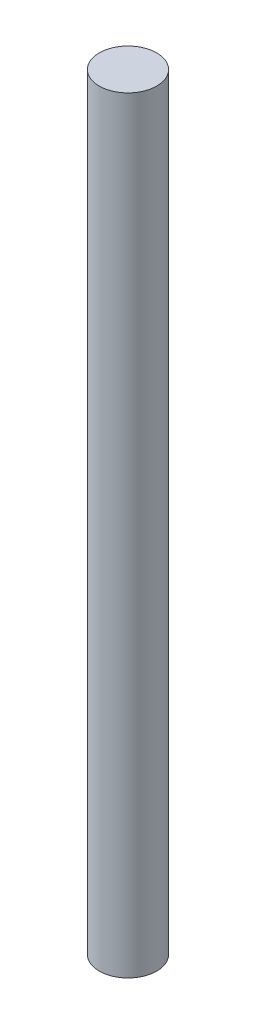
ISO-10303-21;
HEADER;
FILE_DESCRIPTION(('STEP AP214'),'2;1');
FILE_NAME('part.step','',(''),(''),'','','');
FILE_SCHEMA(('AUTOMOTIVE_DESIGN { 1 0 10303 214 1 1 1 1 }'));
ENDSEC;
DATA;
#1=APPLICATION_CONTEXT('core data for automotive mechanical design processes');
#2=APPLICATION_PROTOCOL_DEFINITION('international standard','automotive_design',2000,#1);
#3=PRODUCT_CONTEXT('',#1,'mechanical');
#4=PRODUCT('Part','Part','',(#3));
#5=PRODUCT_RELATED_PRODUCT_CATEGORY('part','',(#4));
#6=PRODUCT_DEFINITION_FORMATION('','',#4);
#7=PRODUCT_DEFINITION_CONTEXT('part definition',#1,'design');
#8=PRODUCT_DEFINITION('design','',#6,#7);
#9=PRODUCT_DEFINITION_SHAPE('','',#8);
#10=(LENGTH_UNIT() NAMED_UNIT(*) SI_UNIT(.MILLI.,.METRE.));
#11=(NAMED_UNIT(*) PLANE_ANGLE_UNIT() SI_UNIT($,.RADIAN.));
#12=(NAMED_UNIT(*) SI_UNIT($,.STERADIAN.) SOLID_ANGLE_UNIT());
#13=UNCERTAINTY_MEASURE_WITH_UNIT(LENGTH_MEASURE(1.E-05),#10,'distance_accuracy_value','');
#14=(GEOMETRIC_REPRESENTATION_CONTEXT(3) GLOBAL_UNCERTAINTY_ASSIGNED_CONTEXT((#13)) GLOBAL_UNIT_ASSIGNED_CONTEXT((#10,
#11,#12)) REPRESENTATION_CONTEXT('',''));
#15=CARTESIAN_POINT('',(0.,0.,0.));
#16=DIRECTION('',(0.,0.,1.));
#17=DIRECTION('',(1.,0.,0.));
#18=AXIS2_PLACEMENT_3D('',#15,#16,#17);
#19=CARTESIAN_POINT('',(0.,40.,0.));
#20=DIRECTION('',(0.,-1.,0.));
#21=DIRECTION('',(0.,0.,-1.));
#22=AXIS2_PLACEMENT_3D('',#19,#20,#21);
#23=CYLINDRICAL_SURFACE('',#22,1.5);
#24=CARTESIAN_POINT('',(0.,40.,0.));
#25=DIRECTION('',(0.,1.,0.));
#26=DIRECTION('',(0.,0.,1.));
#27=AXIS2_PLACEMENT_3D('',#24,#25,#26);
#28=CIRCLE('',#27,1.5);
#29=CARTESIAN_POINT('',(0.,40.,1.5));
#30=VERTEX_POINT('',#29);
#31=EDGE_CURVE('E10',#30,#30,#28,.T.);
#32=ORIENTED_EDGE('',*,*,#31,.F.);
#33=EDGE_LOOP('',(#32));
#34=FACE_BOUND('',#33,.T.);
#35=CARTESIAN_POINT('',(0.,0.,0.));
#36=DIRECTION('',(0.,1.,0.));
#37=DIRECTION('',(0.,0.,1.));
#38=AXIS2_PLACEMENT_3D('',#35,#36,#37);
#39=CIRCLE('',#38,1.5);
#40=CARTESIAN_POINT('',(0.,0.,1.5));
#41=VERTEX_POINT('',#40);
#42=EDGE_CURVE('E41',#41,#41,#39,.T.);
#43=ORIENTED_EDGE('',*,*,#42,.T.);
#44=EDGE_LOOP('',(#43));
#45=FACE_BOUND('',#44,.T.);
#46=ADVANCED_FACE('F38',(#34,#45),#23,.T.);
#47=CARTESIAN_POINT('',(0.,40.,0.));
#48=DIRECTION('',(0.,1.,0.));
#49=DIRECTION('',(0.,0.,1.));
#50=AXIS2_PLACEMENT_3D('',#47,#48,#49);
#51=PLANE('',#50);
#52=ORIENTED_EDGE('',*,*,#31,.T.);
#53=EDGE_LOOP('',(#52));
#54=FACE_BOUND('',#53,.T.);
#55=ADVANCED_FACE('F54',(#54),#51,.T.);
#56=CARTESIAN_POINT('',(0.,0.,0.));
#57=DIRECTION('',(0.,1.,0.));
#58=DIRECTION('',(0.,0.,1.));
#59=AXIS2_PLACEMENT_3D('',#56,#57,#58);
#60=PLANE('',#59);
#61=ORIENTED_EDGE('',*,*,#42,.F.);
#62=EDGE_LOOP('',(#61));
#63=FACE_BOUND('',#62,.T.);
#64=ADVANCED_FACE('F52',(#63),#60,.F.);
#65=CLOSED_SHELL('',(#46,#55,#64));
#66=MANIFOLD_SOLID_BREP('B2',#65);
#67=ADVANCED_BREP_SHAPE_REPRESENTATION('',(#18,#66),#14);
#68=SHAPE_DEFINITION_REPRESENTATION(#9,#67);
ENDSEC;
END-ISO-10303-21;
